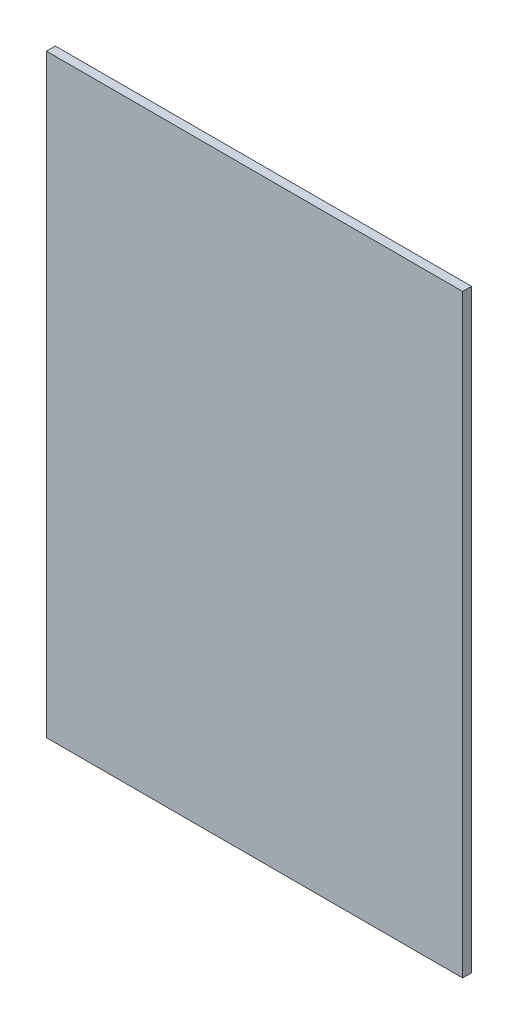
ISO-10303-21;
HEADER;
FILE_DESCRIPTION(('STEP AP214'),'2;1');
FILE_NAME('part.step','',(''),(''),'','','');
FILE_SCHEMA(('AUTOMOTIVE_DESIGN { 1 0 10303 214 1 1 1 1 }'));
ENDSEC;
DATA;
#1=APPLICATION_CONTEXT('core data for automotive mechanical design processes');
#2=APPLICATION_PROTOCOL_DEFINITION('international standard','automotive_design',2000,#1);
#3=PRODUCT_CONTEXT('',#1,'mechanical');
#4=PRODUCT('Part','Part','',(#3));
#5=PRODUCT_RELATED_PRODUCT_CATEGORY('part','',(#4));
#6=PRODUCT_DEFINITION_FORMATION('','',#4);
#7=PRODUCT_DEFINITION_CONTEXT('part definition',#1,'design');
#8=PRODUCT_DEFINITION('design','',#6,#7);
#9=PRODUCT_DEFINITION_SHAPE('','',#8);
#10=(LENGTH_UNIT() NAMED_UNIT(*) SI_UNIT(.MILLI.,.METRE.));
#11=(NAMED_UNIT(*) PLANE_ANGLE_UNIT() SI_UNIT($,.RADIAN.));
#12=(NAMED_UNIT(*) SI_UNIT($,.STERADIAN.) SOLID_ANGLE_UNIT());
#13=UNCERTAINTY_MEASURE_WITH_UNIT(LENGTH_MEASURE(1.E-05),#10,'distance_accuracy_value','');
#14=(GEOMETRIC_REPRESENTATION_CONTEXT(3) GLOBAL_UNCERTAINTY_ASSIGNED_CONTEXT((#13)) GLOBAL_UNIT_ASSIGNED_CONTEXT((#10,
#11,#12)) REPRESENTATION_CONTEXT('',''));
#15=CARTESIAN_POINT('',(0.,0.,0.));
#16=DIRECTION('',(0.,0.,1.));
#17=DIRECTION('',(1.,0.,0.));
#18=AXIS2_PLACEMENT_3D('',#15,#16,#17);
#19=CARTESIAN_POINT('',(700.,-1000.,30.));
#20=DIRECTION('',(-1.,0.,0.));
#21=DIRECTION('',(0.,0.,1.));
#22=AXIS2_PLACEMENT_3D('',#19,#20,#21);
#23=PLANE('',#22);
#24=DIRECTION('',(0.,1.,0.));
#25=VECTOR('',#24,1.);
#26=CARTESIAN_POINT('',(700.,-1000.,0.));
#27=LINE('',#26,#25);
#28=CARTESIAN_POINT('',(700.,-1000.,0.));
#29=VERTEX_POINT('',#28);
#30=CARTESIAN_POINT('',(700.,1000.,0.));
#31=VERTEX_POINT('',#30);
#32=EDGE_CURVE('E96',#29,#31,#27,.T.);
#33=ORIENTED_EDGE('',*,*,#32,.T.);
#34=DIRECTION('',(0.,0.,-1.));
#35=VECTOR('',#34,1.);
#36=CARTESIAN_POINT('',(700.,1000.,30.));
#37=LINE('',#36,#35);
#38=CARTESIAN_POINT('',(700.,1000.,30.));
#39=VERTEX_POINT('',#38);
#40=EDGE_CURVE('E11',#39,#31,#37,.T.);
#41=ORIENTED_EDGE('',*,*,#40,.F.);
#42=DIRECTION('',(0.,1.,0.));
#43=VECTOR('',#42,1.);
#44=CARTESIAN_POINT('',(700.,-1000.,30.));
#45=LINE('',#44,#43);
#46=CARTESIAN_POINT('',(700.,-1000.,30.));
#47=VERTEX_POINT('',#46);
#48=EDGE_CURVE('E84',#47,#39,#45,.T.);
#49=ORIENTED_EDGE('',*,*,#48,.F.);
#50=DIRECTION('',(0.,0.,-1.));
#51=VECTOR('',#50,1.);
#52=CARTESIAN_POINT('',(700.,-1000.,30.));
#53=LINE('',#52,#51);
#54=EDGE_CURVE('E92',#47,#29,#53,.T.);
#55=ORIENTED_EDGE('',*,*,#54,.T.);
#56=EDGE_LOOP('',(#33,#41,#49,#55));
#57=FACE_BOUND('',#56,.T.);
#58=ADVANCED_FACE('F33',(#57),#23,.F.);
#59=CARTESIAN_POINT('',(-700.,1000.,30.));
#60=DIRECTION('',(0.,-1.,0.));
#61=DIRECTION('',(0.,0.,-1.));
#62=AXIS2_PLACEMENT_3D('',#59,#60,#61);
#63=PLANE('',#62);
#64=DIRECTION('',(-1.,0.,0.));
#65=VECTOR('',#64,1.);
#66=CARTESIAN_POINT('',(-700.,1000.,0.));
#67=LINE('',#66,#65);
#68=CARTESIAN_POINT('',(-700.,1000.,0.));
#69=VERTEX_POINT('',#68);
#70=EDGE_CURVE('E88',#31,#69,#67,.T.);
#71=ORIENTED_EDGE('',*,*,#70,.T.);
#72=DIRECTION('',(0.,0.,-1.));
#73=VECTOR('',#72,1.);
#74=CARTESIAN_POINT('',(-700.,1000.,30.));
#75=LINE('',#74,#73);
#76=CARTESIAN_POINT('',(-700.,1000.,30.));
#77=VERTEX_POINT('',#76);
#78=EDGE_CURVE('E41',#77,#69,#75,.T.);
#79=ORIENTED_EDGE('',*,*,#78,.F.);
#80=DIRECTION('',(-1.,0.,0.));
#81=VECTOR('',#80,1.);
#82=CARTESIAN_POINT('',(-700.,1000.,30.));
#83=LINE('',#82,#81);
#84=EDGE_CURVE('E79',#39,#77,#83,.T.);
#85=ORIENTED_EDGE('',*,*,#84,.F.);
#86=ORIENTED_EDGE('',*,*,#40,.T.);
#87=EDGE_LOOP('',(#71,#79,#85,#86));
#88=FACE_BOUND('',#87,.T.);
#89=ADVANCED_FACE('F87',(#88),#63,.F.);
#90=CARTESIAN_POINT('',(-700.,-1000.,30.));
#91=DIRECTION('',(1.,0.,0.));
#92=DIRECTION('',(0.,0.,-1.));
#93=AXIS2_PLACEMENT_3D('',#90,#91,#92);
#94=PLANE('',#93);
#95=DIRECTION('',(0.,-1.,0.));
#96=VECTOR('',#95,1.);
#97=CARTESIAN_POINT('',(-700.,-1000.,0.));
#98=LINE('',#97,#96);
#99=CARTESIAN_POINT('',(-700.,-1000.,0.));
#100=VERTEX_POINT('',#99);
#101=EDGE_CURVE('E66',#69,#100,#98,.T.);
#102=ORIENTED_EDGE('',*,*,#101,.T.);
#103=DIRECTION('',(0.,0.,-1.));
#104=VECTOR('',#103,1.);
#105=CARTESIAN_POINT('',(-700.,-1000.,30.));
#106=LINE('',#105,#104);
#107=CARTESIAN_POINT('',(-700.,-1000.,30.));
#108=VERTEX_POINT('',#107);
#109=EDGE_CURVE('E89',#108,#100,#106,.T.);
#110=ORIENTED_EDGE('',*,*,#109,.F.);
#111=DIRECTION('',(0.,-1.,0.));
#112=VECTOR('',#111,1.);
#113=CARTESIAN_POINT('',(-700.,-1000.,30.));
#114=LINE('',#113,#112);
#115=EDGE_CURVE('E82',#77,#108,#114,.T.);
#116=ORIENTED_EDGE('',*,*,#115,.F.);
#117=ORIENTED_EDGE('',*,*,#78,.T.);
#118=EDGE_LOOP('',(#102,#110,#116,#117));
#119=FACE_BOUND('',#118,.T.);
#120=ADVANCED_FACE('F90',(#119),#94,.F.);
#121=CARTESIAN_POINT('',(-700.,-1000.,30.));
#122=DIRECTION('',(0.,1.,0.));
#123=DIRECTION('',(0.,0.,1.));
#124=AXIS2_PLACEMENT_3D('',#121,#122,#123);
#125=PLANE('',#124);
#126=DIRECTION('',(1.,0.,0.));
#127=VECTOR('',#126,1.);
#128=CARTESIAN_POINT('',(-700.,-1000.,0.));
#129=LINE('',#128,#127);
#130=EDGE_CURVE('E72',#100,#29,#129,.T.);
#131=ORIENTED_EDGE('',*,*,#130,.T.);
#132=ORIENTED_EDGE('',*,*,#54,.F.);
#133=DIRECTION('',(1.,0.,0.));
#134=VECTOR('',#133,1.);
#135=CARTESIAN_POINT('',(-700.,-1000.,30.));
#136=LINE('',#135,#134);
#137=EDGE_CURVE('E49',#108,#47,#136,.T.);
#138=ORIENTED_EDGE('',*,*,#137,.F.);
#139=ORIENTED_EDGE('',*,*,#109,.T.);
#140=EDGE_LOOP('',(#131,#132,#138,#139));
#141=FACE_BOUND('',#140,.T.);
#142=ADVANCED_FACE('F103',(#141),#125,.F.);
#143=CARTESIAN_POINT('',(0.,0.,30.));
#144=DIRECTION('',(0.,0.,-1.));
#145=DIRECTION('',(-1.,0.,0.));
#146=AXIS2_PLACEMENT_3D('',#143,#144,#145);
#147=PLANE('',#146);
#148=ORIENTED_EDGE('',*,*,#48,.T.);
#149=ORIENTED_EDGE('',*,*,#84,.T.);
#150=ORIENTED_EDGE('',*,*,#115,.T.);
#151=ORIENTED_EDGE('',*,*,#137,.T.);
#152=EDGE_LOOP('',(#148,#149,#150,#151));
#153=FACE_BOUND('',#152,.T.);
#154=ADVANCED_FACE('F80',(#153),#147,.F.);
#155=CARTESIAN_POINT('',(0.,0.,0.));
#156=DIRECTION('',(0.,0.,-1.));
#157=DIRECTION('',(-1.,0.,0.));
#158=AXIS2_PLACEMENT_3D('',#155,#156,#157);
#159=PLANE('',#158);
#160=ORIENTED_EDGE('',*,*,#32,.F.);
#161=ORIENTED_EDGE('',*,*,#130,.F.);
#162=ORIENTED_EDGE('',*,*,#101,.F.);
#163=ORIENTED_EDGE('',*,*,#70,.F.);
#164=EDGE_LOOP('',(#160,#161,#162,#163));
#165=FACE_BOUND('',#164,.T.);
#166=ADVANCED_FACE('F106',(#165),#159,.T.);
#167=CLOSED_SHELL('',(#58,#89,#120,#142,#154,#166));
#168=MANIFOLD_SOLID_BREP('B2',#167);
#169=ADVANCED_BREP_SHAPE_REPRESENTATION('',(#18,#168),#14);
#170=SHAPE_DEFINITION_REPRESENTATION(#9,#169);
ENDSEC;
END-ISO-10303-21;
